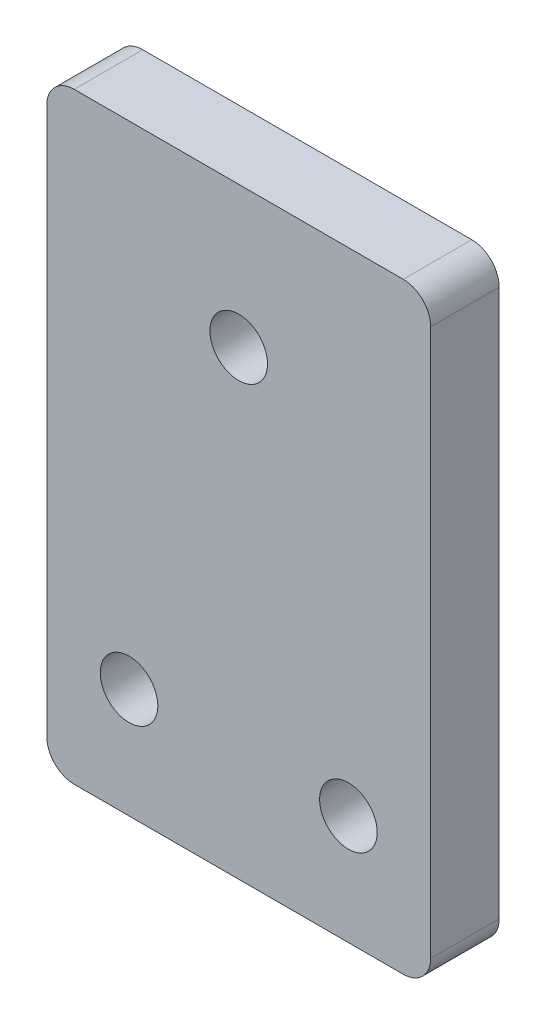
ISO-10303-21;
HEADER;
FILE_DESCRIPTION(('STEP AP214'),'2;1');
FILE_NAME('part.step','',(''),(''),'','','');
FILE_SCHEMA(('AUTOMOTIVE_DESIGN { 1 0 10303 214 1 1 1 1 }'));
ENDSEC;
DATA;
#1=APPLICATION_CONTEXT('core data for automotive mechanical design processes');
#2=APPLICATION_PROTOCOL_DEFINITION('international standard','automotive_design',2000,#1);
#3=PRODUCT_CONTEXT('',#1,'mechanical');
#4=PRODUCT('Part','Part','',(#3));
#5=PRODUCT_RELATED_PRODUCT_CATEGORY('part','',(#4));
#6=PRODUCT_DEFINITION_FORMATION('','',#4);
#7=PRODUCT_DEFINITION_CONTEXT('part definition',#1,'design');
#8=PRODUCT_DEFINITION('design','',#6,#7);
#9=PRODUCT_DEFINITION_SHAPE('','',#8);
#10=(LENGTH_UNIT() NAMED_UNIT(*) SI_UNIT(.MILLI.,.METRE.));
#11=(NAMED_UNIT(*) PLANE_ANGLE_UNIT() SI_UNIT($,.RADIAN.));
#12=(NAMED_UNIT(*) SI_UNIT($,.STERADIAN.) SOLID_ANGLE_UNIT());
#13=UNCERTAINTY_MEASURE_WITH_UNIT(LENGTH_MEASURE(1.E-05),#10,'distance_accuracy_value','');
#14=(GEOMETRIC_REPRESENTATION_CONTEXT(3) GLOBAL_UNCERTAINTY_ASSIGNED_CONTEXT((#13)) GLOBAL_UNIT_ASSIGNED_CONTEXT((#10,
#11,#12)) REPRESENTATION_CONTEXT('',''));
#15=CARTESIAN_POINT('',(0.,0.,0.));
#16=DIRECTION('',(0.,0.,1.));
#17=DIRECTION('',(1.,0.,0.));
#18=AXIS2_PLACEMENT_3D('',#15,#16,#17);
#19=CARTESIAN_POINT('',(-54.5,-8.99999999999985,57.0692807709114));
#20=DIRECTION('',(0.,0.,-1.));
#21=DIRECTION('',(-1.,0.,0.));
#22=AXIS2_PLACEMENT_3D('',#19,#20,#21);
#23=CYLINDRICAL_SURFACE('',#22,2.1);
#24=CARTESIAN_POINT('',(-54.5,-8.99999999999985,0.));
#25=DIRECTION('',(0.,0.,1.));
#26=DIRECTION('',(1.,0.,0.));
#27=AXIS2_PLACEMENT_3D('',#24,#25,#26);
#28=CIRCLE('',#27,2.1);
#29=CARTESIAN_POINT('',(-52.4,-8.99999999999985,0.));
#30=VERTEX_POINT('',#29);
#31=EDGE_CURVE('E193',#30,#30,#28,.T.);
#32=ORIENTED_EDGE('',*,*,#31,.F.);
#33=EDGE_LOOP('',(#32));
#34=FACE_BOUND('',#33,.T.);
#35=CARTESIAN_POINT('',(-54.5,-8.99999999999985,5.));
#36=DIRECTION('',(0.,0.,1.));
#37=DIRECTION('',(1.,0.,0.));
#38=AXIS2_PLACEMENT_3D('',#35,#36,#37);
#39=CIRCLE('',#38,2.1);
#40=CARTESIAN_POINT('',(-52.4,-8.99999999999985,5.));
#41=VERTEX_POINT('',#40);
#42=EDGE_CURVE('E179',#41,#41,#39,.T.);
#43=ORIENTED_EDGE('',*,*,#42,.T.);
#44=EDGE_LOOP('',(#43));
#45=FACE_BOUND('',#44,.T.);
#46=ADVANCED_FACE('F33',(#34,#45),#23,.F.);
#47=CARTESIAN_POINT('',(-70.5,-8.99999999999985,57.0692807709114));
#48=DIRECTION('',(0.,0.,-1.));
#49=DIRECTION('',(-1.,0.,0.));
#50=AXIS2_PLACEMENT_3D('',#47,#48,#49);
#51=CYLINDRICAL_SURFACE('',#50,2.1);
#52=CARTESIAN_POINT('',(-70.5,-8.99999999999985,0.));
#53=DIRECTION('',(0.,0.,1.));
#54=DIRECTION('',(1.,0.,0.));
#55=AXIS2_PLACEMENT_3D('',#52,#53,#54);
#56=CIRCLE('',#55,2.1);
#57=CARTESIAN_POINT('',(-68.4,-8.99999999999985,0.));
#58=VERTEX_POINT('',#57);
#59=EDGE_CURVE('E173',#58,#58,#56,.T.);
#60=ORIENTED_EDGE('',*,*,#59,.F.);
#61=EDGE_LOOP('',(#60));
#62=FACE_BOUND('',#61,.T.);
#63=CARTESIAN_POINT('',(-70.5,-8.99999999999985,5.));
#64=DIRECTION('',(0.,0.,1.));
#65=DIRECTION('',(1.,0.,0.));
#66=AXIS2_PLACEMENT_3D('',#63,#64,#65);
#67=CIRCLE('',#66,2.1);
#68=CARTESIAN_POINT('',(-68.4,-8.99999999999985,5.));
#69=VERTEX_POINT('',#68);
#70=EDGE_CURVE('E121',#69,#69,#67,.T.);
#71=ORIENTED_EDGE('',*,*,#70,.T.);
#72=EDGE_LOOP('',(#71));
#73=FACE_BOUND('',#72,.T.);
#74=ADVANCED_FACE('F199',(#62,#73),#51,.F.);
#75=CARTESIAN_POINT('',(-76.5,26.9000000000002,57.0692807709114));
#76=DIRECTION('',(0.,-1.,0.));
#77=DIRECTION('',(0.,0.,-1.));
#78=AXIS2_PLACEMENT_3D('',#75,#76,#77);
#79=PLANE('',#78);
#80=DIRECTION('',(-1.,0.,0.));
#81=VECTOR('',#80,1.);
#82=CARTESIAN_POINT('',(-76.5,26.9000000000002,5.));
#83=LINE('',#82,#81);
#84=CARTESIAN_POINT('',(-50.5,26.9000000000002,5.));
#85=VERTEX_POINT('',#84);
#86=CARTESIAN_POINT('',(-74.5,26.9000000000002,5.));
#87=VERTEX_POINT('',#86);
#88=EDGE_CURVE('E103',#85,#87,#83,.T.);
#89=ORIENTED_EDGE('',*,*,#88,.F.);
#90=DIRECTION('',(0.,0.,-1.));
#91=VECTOR('',#90,1.);
#92=CARTESIAN_POINT('',(-50.5,26.9000000000002,57.0692807709114));
#93=LINE('',#92,#91);
#94=CARTESIAN_POINT('',(-50.5,26.9000000000002,0.));
#95=VERTEX_POINT('',#94);
#96=EDGE_CURVE('E117',#85,#95,#93,.T.);
#97=ORIENTED_EDGE('',*,*,#96,.T.);
#98=DIRECTION('',(-1.,0.,0.));
#99=VECTOR('',#98,1.);
#100=CARTESIAN_POINT('',(-76.5,26.9000000000002,0.));
#101=LINE('',#100,#99);
#102=CARTESIAN_POINT('',(-74.5,26.9000000000002,0.));
#103=VERTEX_POINT('',#102);
#104=EDGE_CURVE('E129',#95,#103,#101,.T.);
#105=ORIENTED_EDGE('',*,*,#104,.T.);
#106=DIRECTION('',(0.,0.,-1.));
#107=VECTOR('',#106,1.);
#108=CARTESIAN_POINT('',(-74.5,26.9000000000002,57.0692807709114));
#109=LINE('',#108,#107);
#110=EDGE_CURVE('E120',#103,#87,#109,.F.);
#111=ORIENTED_EDGE('',*,*,#110,.T.);
#112=EDGE_LOOP('',(#89,#97,#105,#111));
#113=FACE_BOUND('',#112,.T.);
#114=ADVANCED_FACE('F115',(#113),#79,.F.);
#115=CARTESIAN_POINT('',(-48.5,26.9000000000002,57.0692807709114));
#116=DIRECTION('',(-1.,0.,0.));
#117=DIRECTION('',(0.,0.,1.));
#118=AXIS2_PLACEMENT_3D('',#115,#116,#117);
#119=PLANE('',#118);
#120=DIRECTION('',(0.,1.,0.));
#121=VECTOR('',#120,1.);
#122=CARTESIAN_POINT('',(-48.5,26.9000000000002,0.));
#123=LINE('',#122,#121);
#124=CARTESIAN_POINT('',(-48.5,-14.9999999999999,0.));
#125=VERTEX_POINT('',#124);
#126=CARTESIAN_POINT('',(-48.5,24.9000000000002,0.));
#127=VERTEX_POINT('',#126);
#128=EDGE_CURVE('E169',#125,#127,#123,.T.);
#129=ORIENTED_EDGE('',*,*,#128,.T.);
#130=DIRECTION('',(0.,0.,-1.));
#131=VECTOR('',#130,1.);
#132=CARTESIAN_POINT('',(-48.5,24.9000000000002,57.0692807709114));
#133=LINE('',#132,#131);
#134=CARTESIAN_POINT('',(-48.5,24.9000000000002,5.));
#135=VERTEX_POINT('',#134);
#136=EDGE_CURVE('E140',#127,#135,#133,.F.);
#137=ORIENTED_EDGE('',*,*,#136,.T.);
#138=DIRECTION('',(0.,1.,0.));
#139=VECTOR('',#138,1.);
#140=CARTESIAN_POINT('',(-48.5,26.9000000000002,5.));
#141=LINE('',#140,#139);
#142=CARTESIAN_POINT('',(-48.5,-14.9999999999999,5.));
#143=VERTEX_POINT('',#142);
#144=EDGE_CURVE('E106',#143,#135,#141,.T.);
#145=ORIENTED_EDGE('',*,*,#144,.F.);
#146=DIRECTION('',(0.,0.,-1.));
#147=VECTOR('',#146,1.);
#148=CARTESIAN_POINT('',(-48.5,-14.9999999999999,57.0692807709114));
#149=LINE('',#148,#147);
#150=EDGE_CURVE('E137',#143,#125,#149,.T.);
#151=ORIENTED_EDGE('',*,*,#150,.T.);
#152=EDGE_LOOP('',(#129,#137,#145,#151));
#153=FACE_BOUND('',#152,.T.);
#154=ADVANCED_FACE('F229',(#153),#119,.F.);
#155=CARTESIAN_POINT('',(-76.5,-16.9999999999998,57.0692807709114));
#156=DIRECTION('',(0.,1.,0.));
#157=DIRECTION('',(0.,0.,1.));
#158=AXIS2_PLACEMENT_3D('',#155,#156,#157);
#159=PLANE('',#158);
#160=DIRECTION('',(1.,0.,0.));
#161=VECTOR('',#160,1.);
#162=CARTESIAN_POINT('',(-76.5,-16.9999999999998,0.));
#163=LINE('',#162,#161);
#164=CARTESIAN_POINT('',(-74.5,-16.9999999999998,0.));
#165=VERTEX_POINT('',#164);
#166=CARTESIAN_POINT('',(-50.5,-16.9999999999998,0.));
#167=VERTEX_POINT('',#166);
#168=EDGE_CURVE('E164',#165,#167,#163,.T.);
#169=ORIENTED_EDGE('',*,*,#168,.T.);
#170=DIRECTION('',(0.,0.,-1.));
#171=VECTOR('',#170,1.);
#172=CARTESIAN_POINT('',(-50.5,-16.9999999999998,57.0692807709114));
#173=LINE('',#172,#171);
#174=CARTESIAN_POINT('',(-50.5,-16.9999999999998,5.));
#175=VERTEX_POINT('',#174);
#176=EDGE_CURVE('E48',#167,#175,#173,.F.);
#177=ORIENTED_EDGE('',*,*,#176,.T.);
#178=DIRECTION('',(1.,0.,0.));
#179=VECTOR('',#178,1.);
#180=CARTESIAN_POINT('',(-76.5,-16.9999999999998,5.));
#181=LINE('',#180,#179);
#182=CARTESIAN_POINT('',(-74.5,-16.9999999999998,5.));
#183=VERTEX_POINT('',#182);
#184=EDGE_CURVE('E159',#183,#175,#181,.T.);
#185=ORIENTED_EDGE('',*,*,#184,.F.);
#186=DIRECTION('',(0.,0.,-1.));
#187=VECTOR('',#186,1.);
#188=CARTESIAN_POINT('',(-74.5,-16.9999999999998,57.0692807709114));
#189=LINE('',#188,#187);
#190=EDGE_CURVE('E110',#183,#165,#189,.T.);
#191=ORIENTED_EDGE('',*,*,#190,.T.);
#192=EDGE_LOOP('',(#169,#177,#185,#191));
#193=FACE_BOUND('',#192,.T.);
#194=ADVANCED_FACE('F163',(#193),#159,.F.);
#195=CARTESIAN_POINT('',(-76.5,26.9000000000002,57.0692807709114));
#196=DIRECTION('',(1.,0.,0.));
#197=DIRECTION('',(0.,0.,-1.));
#198=AXIS2_PLACEMENT_3D('',#195,#196,#197);
#199=PLANE('',#198);
#200=DIRECTION('',(0.,-1.,0.));
#201=VECTOR('',#200,1.);
#202=CARTESIAN_POINT('',(-76.5,26.9000000000002,5.));
#203=LINE('',#202,#201);
#204=CARTESIAN_POINT('',(-76.5,24.9000000000002,5.));
#205=VERTEX_POINT('',#204);
#206=CARTESIAN_POINT('',(-76.5,-14.9999999999999,5.));
#207=VERTEX_POINT('',#206);
#208=EDGE_CURVE('E153',#205,#207,#203,.T.);
#209=ORIENTED_EDGE('',*,*,#208,.F.);
#210=DIRECTION('',(0.,0.,-1.));
#211=VECTOR('',#210,1.);
#212=CARTESIAN_POINT('',(-76.5,24.9000000000002,57.0692807709114));
#213=LINE('',#212,#211);
#214=CARTESIAN_POINT('',(-76.5,24.9000000000002,0.));
#215=VERTEX_POINT('',#214);
#216=EDGE_CURVE('E11',#205,#215,#213,.T.);
#217=ORIENTED_EDGE('',*,*,#216,.T.);
#218=DIRECTION('',(0.,-1.,0.));
#219=VECTOR('',#218,1.);
#220=CARTESIAN_POINT('',(-76.5,26.9000000000002,0.));
#221=LINE('',#220,#219);
#222=CARTESIAN_POINT('',(-76.5,-14.9999999999999,0.));
#223=VERTEX_POINT('',#222);
#224=EDGE_CURVE('E156',#215,#223,#221,.T.);
#225=ORIENTED_EDGE('',*,*,#224,.T.);
#226=DIRECTION('',(0.,0.,-1.));
#227=VECTOR('',#226,1.);
#228=CARTESIAN_POINT('',(-76.5,-14.9999999999999,57.0692807709114));
#229=LINE('',#228,#227);
#230=EDGE_CURVE('E41',#223,#207,#229,.F.);
#231=ORIENTED_EDGE('',*,*,#230,.T.);
#232=EDGE_LOOP('',(#209,#217,#225,#231));
#233=FACE_BOUND('',#232,.T.);
#234=ADVANCED_FACE('F152',(#233),#199,.F.);
#235=CARTESIAN_POINT('',(0.,0.,0.));
#236=DIRECTION('',(0.,0.,1.));
#237=DIRECTION('',(1.,0.,0.));
#238=AXIS2_PLACEMENT_3D('',#235,#236,#237);
#239=PLANE('',#238);
#240=ORIENTED_EDGE('',*,*,#104,.F.);
#241=CARTESIAN_POINT('',(-50.5,24.9000000000002,0.));
#242=DIRECTION('',(0.,0.,1.));
#243=DIRECTION('',(1.,0.,0.));
#244=AXIS2_PLACEMENT_3D('',#241,#242,#243);
#245=CIRCLE('',#244,2.);
#246=EDGE_CURVE('E124',#95,#127,#245,.F.);
#247=ORIENTED_EDGE('',*,*,#246,.T.);
#248=ORIENTED_EDGE('',*,*,#128,.F.);
#249=CARTESIAN_POINT('',(-50.5,-14.9999999999999,0.));
#250=DIRECTION('',(0.,0.,1.));
#251=DIRECTION('',(1.,0.,0.));
#252=AXIS2_PLACEMENT_3D('',#249,#250,#251);
#253=CIRCLE('',#252,2.);
#254=EDGE_CURVE('E134',#125,#167,#253,.F.);
#255=ORIENTED_EDGE('',*,*,#254,.T.);
#256=ORIENTED_EDGE('',*,*,#168,.F.);
#257=CARTESIAN_POINT('',(-74.5,-14.9999999999998,0.));
#258=DIRECTION('',(0.,0.,1.));
#259=DIRECTION('',(1.,0.,0.));
#260=AXIS2_PLACEMENT_3D('',#257,#258,#259);
#261=CIRCLE('',#260,2.);
#262=EDGE_CURVE('E125',#165,#223,#261,.F.);
#263=ORIENTED_EDGE('',*,*,#262,.T.);
#264=ORIENTED_EDGE('',*,*,#224,.F.);
#265=CARTESIAN_POINT('',(-74.5,24.9000000000002,0.));
#266=DIRECTION('',(0.,0.,1.));
#267=DIRECTION('',(1.,0.,0.));
#268=AXIS2_PLACEMENT_3D('',#265,#266,#267);
#269=CIRCLE('',#268,2.);
#270=EDGE_CURVE('E127',#215,#103,#269,.F.);
#271=ORIENTED_EDGE('',*,*,#270,.T.);
#272=EDGE_LOOP('',(#240,#247,#248,#255,#256,#263,#264,#271));
#273=FACE_BOUND('',#272,.T.);
#274=ORIENTED_EDGE('',*,*,#59,.T.);
#275=EDGE_LOOP('',(#274));
#276=FACE_BOUND('',#275,.T.);
#277=ORIENTED_EDGE('',*,*,#31,.T.);
#278=EDGE_LOOP('',(#277));
#279=FACE_BOUND('',#278,.T.);
#280=CARTESIAN_POINT('',(-62.5,16.6000000000002,0.));
#281=DIRECTION('',(0.,0.,1.));
#282=DIRECTION('',(1.,0.,0.));
#283=AXIS2_PLACEMENT_3D('',#280,#281,#282);
#284=CIRCLE('',#283,2.1);
#285=CARTESIAN_POINT('',(-60.4,16.6000000000002,0.));
#286=VERTEX_POINT('',#285);
#287=EDGE_CURVE('E158',#286,#286,#284,.T.);
#288=ORIENTED_EDGE('',*,*,#287,.T.);
#289=EDGE_LOOP('',(#288));
#290=FACE_BOUND('',#289,.T.);
#291=ADVANCED_FACE('F166',(#273,#276,#279,#290),#239,.F.);
#292=CARTESIAN_POINT('',(-62.5,16.6000000000002,57.0692807709114));
#293=DIRECTION('',(0.,0.,-1.));
#294=DIRECTION('',(-1.,0.,0.));
#295=AXIS2_PLACEMENT_3D('',#292,#293,#294);
#296=CYLINDRICAL_SURFACE('',#295,2.1);
#297=ORIENTED_EDGE('',*,*,#287,.F.);
#298=EDGE_LOOP('',(#297));
#299=FACE_BOUND('',#298,.T.);
#300=CARTESIAN_POINT('',(-62.5,16.6000000000002,5.));
#301=DIRECTION('',(0.,0.,1.));
#302=DIRECTION('',(1.,0.,0.));
#303=AXIS2_PLACEMENT_3D('',#300,#301,#302);
#304=CIRCLE('',#303,2.1);
#305=CARTESIAN_POINT('',(-60.4,16.6000000000002,5.));
#306=VERTEX_POINT('',#305);
#307=EDGE_CURVE('E177',#306,#306,#304,.T.);
#308=ORIENTED_EDGE('',*,*,#307,.T.);
#309=EDGE_LOOP('',(#308));
#310=FACE_BOUND('',#309,.T.);
#311=ADVANCED_FACE('F206',(#299,#310),#296,.F.);
#312=CARTESIAN_POINT('',(0.,0.,5.));
#313=DIRECTION('',(0.,0.,1.));
#314=DIRECTION('',(0.,1.,0.));
#315=AXIS2_PLACEMENT_3D('',#312,#313,#314);
#316=PLANE('',#315);
#317=ORIENTED_EDGE('',*,*,#307,.F.);
#318=EDGE_LOOP('',(#317));
#319=FACE_BOUND('',#318,.T.);
#320=ORIENTED_EDGE('',*,*,#42,.F.);
#321=EDGE_LOOP('',(#320));
#322=FACE_BOUND('',#321,.T.);
#323=ORIENTED_EDGE('',*,*,#70,.F.);
#324=EDGE_LOOP('',(#323));
#325=FACE_BOUND('',#324,.T.);
#326=ORIENTED_EDGE('',*,*,#144,.T.);
#327=CARTESIAN_POINT('',(-50.5,24.9000000000002,5.));
#328=DIRECTION('',(0.,0.,1.));
#329=DIRECTION('',(1.,0.,0.));
#330=AXIS2_PLACEMENT_3D('',#327,#328,#329);
#331=CIRCLE('',#330,2.);
#332=EDGE_CURVE('E100',#135,#85,#331,.T.);
#333=ORIENTED_EDGE('',*,*,#332,.T.);
#334=ORIENTED_EDGE('',*,*,#88,.T.);
#335=CARTESIAN_POINT('',(-74.5,24.9000000000002,5.));
#336=DIRECTION('',(0.,0.,1.));
#337=DIRECTION('',(1.,0.,0.));
#338=AXIS2_PLACEMENT_3D('',#335,#336,#337);
#339=CIRCLE('',#338,2.);
#340=EDGE_CURVE('E143',#87,#205,#339,.T.);
#341=ORIENTED_EDGE('',*,*,#340,.T.);
#342=ORIENTED_EDGE('',*,*,#208,.T.);
#343=CARTESIAN_POINT('',(-74.5,-14.9999999999998,5.));
#344=DIRECTION('',(0.,0.,1.));
#345=DIRECTION('',(1.,0.,0.));
#346=AXIS2_PLACEMENT_3D('',#343,#344,#345);
#347=CIRCLE('',#346,2.);
#348=EDGE_CURVE('E55',#207,#183,#347,.T.);
#349=ORIENTED_EDGE('',*,*,#348,.T.);
#350=ORIENTED_EDGE('',*,*,#184,.T.);
#351=CARTESIAN_POINT('',(-50.5,-14.9999999999999,5.));
#352=DIRECTION('',(0.,0.,1.));
#353=DIRECTION('',(1.,0.,0.));
#354=AXIS2_PLACEMENT_3D('',#351,#352,#353);
#355=CIRCLE('',#354,2.);
#356=EDGE_CURVE('E111',#175,#143,#355,.T.);
#357=ORIENTED_EDGE('',*,*,#356,.T.);
#358=EDGE_LOOP('',(#326,#333,#334,#341,#342,#349,#350,#357));
#359=FACE_BOUND('',#358,.T.);
#360=ADVANCED_FACE('F102',(#319,#322,#325,#359),#316,.T.);
#361=CARTESIAN_POINT('',(-50.5,24.9000000000002,57.0692807709114));
#362=DIRECTION('',(0.,0.,-1.));
#363=DIRECTION('',(-1.,0.,0.));
#364=AXIS2_PLACEMENT_3D('',#361,#362,#363);
#365=CYLINDRICAL_SURFACE('',#364,2.);
#366=ORIENTED_EDGE('',*,*,#332,.F.);
#367=ORIENTED_EDGE('',*,*,#136,.F.);
#368=ORIENTED_EDGE('',*,*,#246,.F.);
#369=ORIENTED_EDGE('',*,*,#96,.F.);
#370=EDGE_LOOP('',(#366,#367,#368,#369));
#371=FACE_BOUND('',#370,.T.);
#372=ADVANCED_FACE('F123',(#371),#365,.T.);
#373=CARTESIAN_POINT('',(-50.5,-14.9999999999999,57.0692807709114));
#374=DIRECTION('',(0.,0.,-1.));
#375=DIRECTION('',(-1.,0.,0.));
#376=AXIS2_PLACEMENT_3D('',#373,#374,#375);
#377=CYLINDRICAL_SURFACE('',#376,2.);
#378=ORIENTED_EDGE('',*,*,#356,.F.);
#379=ORIENTED_EDGE('',*,*,#176,.F.);
#380=ORIENTED_EDGE('',*,*,#254,.F.);
#381=ORIENTED_EDGE('',*,*,#150,.F.);
#382=EDGE_LOOP('',(#378,#379,#380,#381));
#383=FACE_BOUND('',#382,.T.);
#384=ADVANCED_FACE('F213',(#383),#377,.T.);
#385=CARTESIAN_POINT('',(-74.5,24.9000000000002,57.0692807709114));
#386=DIRECTION('',(0.,0.,-1.));
#387=DIRECTION('',(-1.,0.,0.));
#388=AXIS2_PLACEMENT_3D('',#385,#386,#387);
#389=CYLINDRICAL_SURFACE('',#388,2.);
#390=ORIENTED_EDGE('',*,*,#340,.F.);
#391=ORIENTED_EDGE('',*,*,#110,.F.);
#392=ORIENTED_EDGE('',*,*,#270,.F.);
#393=ORIENTED_EDGE('',*,*,#216,.F.);
#394=EDGE_LOOP('',(#390,#391,#392,#393));
#395=FACE_BOUND('',#394,.T.);
#396=ADVANCED_FACE('F238',(#395),#389,.T.);
#397=CARTESIAN_POINT('',(-74.5,-14.9999999999998,57.0692807709114));
#398=DIRECTION('',(0.,0.,-1.));
#399=DIRECTION('',(-1.,0.,0.));
#400=AXIS2_PLACEMENT_3D('',#397,#398,#399);
#401=CYLINDRICAL_SURFACE('',#400,2.);
#402=ORIENTED_EDGE('',*,*,#348,.F.);
#403=ORIENTED_EDGE('',*,*,#230,.F.);
#404=ORIENTED_EDGE('',*,*,#262,.F.);
#405=ORIENTED_EDGE('',*,*,#190,.F.);
#406=EDGE_LOOP('',(#402,#403,#404,#405));
#407=FACE_BOUND('',#406,.T.);
#408=ADVANCED_FACE('F35',(#407),#401,.T.);
#409=CLOSED_SHELL('',(#46,#74,#114,#154,#194,#234,#291,#311,#360,#372,#384,#396,#408));
#410=MANIFOLD_SOLID_BREP('B2',#409);
#411=ADVANCED_BREP_SHAPE_REPRESENTATION('',(#18,#410),#14);
#412=SHAPE_DEFINITION_REPRESENTATION(#9,#411);
ENDSEC;
END-ISO-10303-21;
